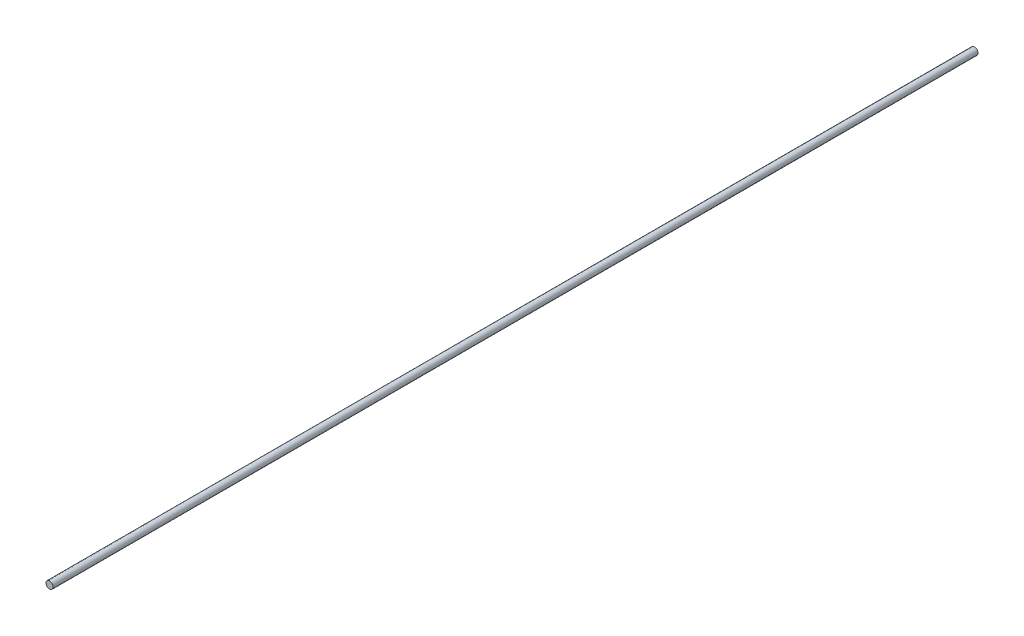
ISO-10303-21;
HEADER;
FILE_DESCRIPTION(('STEP AP214'),'2;1');
FILE_NAME('part.step','',(''),(''),'','','');
FILE_SCHEMA(('AUTOMOTIVE_DESIGN { 1 0 10303 214 1 1 1 1 }'));
ENDSEC;
DATA;
#1=APPLICATION_CONTEXT('core data for automotive mechanical design processes');
#2=APPLICATION_PROTOCOL_DEFINITION('international standard','automotive_design',2000,#1);
#3=PRODUCT_CONTEXT('',#1,'mechanical');
#4=PRODUCT('Part','Part','',(#3));
#5=PRODUCT_RELATED_PRODUCT_CATEGORY('part','',(#4));
#6=PRODUCT_DEFINITION_FORMATION('','',#4);
#7=PRODUCT_DEFINITION_CONTEXT('part definition',#1,'design');
#8=PRODUCT_DEFINITION('design','',#6,#7);
#9=PRODUCT_DEFINITION_SHAPE('','',#8);
#10=(LENGTH_UNIT() NAMED_UNIT(*) SI_UNIT(.MILLI.,.METRE.));
#11=(NAMED_UNIT(*) PLANE_ANGLE_UNIT() SI_UNIT($,.RADIAN.));
#12=(NAMED_UNIT(*) SI_UNIT($,.STERADIAN.) SOLID_ANGLE_UNIT());
#13=UNCERTAINTY_MEASURE_WITH_UNIT(LENGTH_MEASURE(1.E-05),#10,'distance_accuracy_value','');
#14=(GEOMETRIC_REPRESENTATION_CONTEXT(3) GLOBAL_UNCERTAINTY_ASSIGNED_CONTEXT((#13)) GLOBAL_UNIT_ASSIGNED_CONTEXT((#10,
#11,#12)) REPRESENTATION_CONTEXT('',''));
#15=CARTESIAN_POINT('',(0.,0.,0.));
#16=DIRECTION('',(0.,0.,1.));
#17=DIRECTION('',(1.,0.,0.));
#18=AXIS2_PLACEMENT_3D('',#15,#16,#17);
#19=CARTESIAN_POINT('',(0.,0.,1040.));
#20=DIRECTION('',(0.,0.,-1.));
#21=DIRECTION('',(-1.,0.,0.));
#22=AXIS2_PLACEMENT_3D('',#19,#20,#21);
#23=CYLINDRICAL_SURFACE('',#22,4.);
#24=CARTESIAN_POINT('',(0.,0.,1040.));
#25=DIRECTION('',(0.,0.,1.));
#26=DIRECTION('',(1.,0.,0.));
#27=AXIS2_PLACEMENT_3D('',#24,#25,#26);
#28=CIRCLE('',#27,4.);
#29=CARTESIAN_POINT('',(4.,0.,1040.));
#30=VERTEX_POINT('',#29);
#31=EDGE_CURVE('E10',#30,#30,#28,.T.);
#32=ORIENTED_EDGE('',*,*,#31,.F.);
#33=EDGE_LOOP('',(#32));
#34=FACE_BOUND('',#33,.T.);
#35=CARTESIAN_POINT('',(0.,0.,0.));
#36=DIRECTION('',(0.,0.,1.));
#37=DIRECTION('',(1.,0.,0.));
#38=AXIS2_PLACEMENT_3D('',#35,#36,#37);
#39=CIRCLE('',#38,4.);
#40=CARTESIAN_POINT('',(4.,0.,0.));
#41=VERTEX_POINT('',#40);
#42=EDGE_CURVE('E34',#41,#41,#39,.T.);
#43=ORIENTED_EDGE('',*,*,#42,.T.);
#44=EDGE_LOOP('',(#43));
#45=FACE_BOUND('',#44,.T.);
#46=ADVANCED_FACE('F31',(#34,#45),#23,.T.);
#47=CARTESIAN_POINT('',(0.,0.,1040.));
#48=DIRECTION('',(0.,0.,1.));
#49=DIRECTION('',(1.,0.,0.));
#50=AXIS2_PLACEMENT_3D('',#47,#48,#49);
#51=PLANE('',#50);
#52=ORIENTED_EDGE('',*,*,#31,.T.);
#53=EDGE_LOOP('',(#52));
#54=FACE_BOUND('',#53,.T.);
#55=ADVANCED_FACE('F46',(#54),#51,.T.);
#56=CARTESIAN_POINT('',(0.,0.,0.));
#57=DIRECTION('',(0.,0.,1.));
#58=DIRECTION('',(1.,0.,0.));
#59=AXIS2_PLACEMENT_3D('',#56,#57,#58);
#60=PLANE('',#59);
#61=ORIENTED_EDGE('',*,*,#42,.F.);
#62=EDGE_LOOP('',(#61));
#63=FACE_BOUND('',#62,.T.);
#64=ADVANCED_FACE('F44',(#63),#60,.F.);
#65=CLOSED_SHELL('',(#46,#55,#64));
#66=MANIFOLD_SOLID_BREP('B2',#65);
#67=ADVANCED_BREP_SHAPE_REPRESENTATION('',(#18,#66),#14);
#68=SHAPE_DEFINITION_REPRESENTATION(#9,#67);
ENDSEC;
END-ISO-10303-21;
